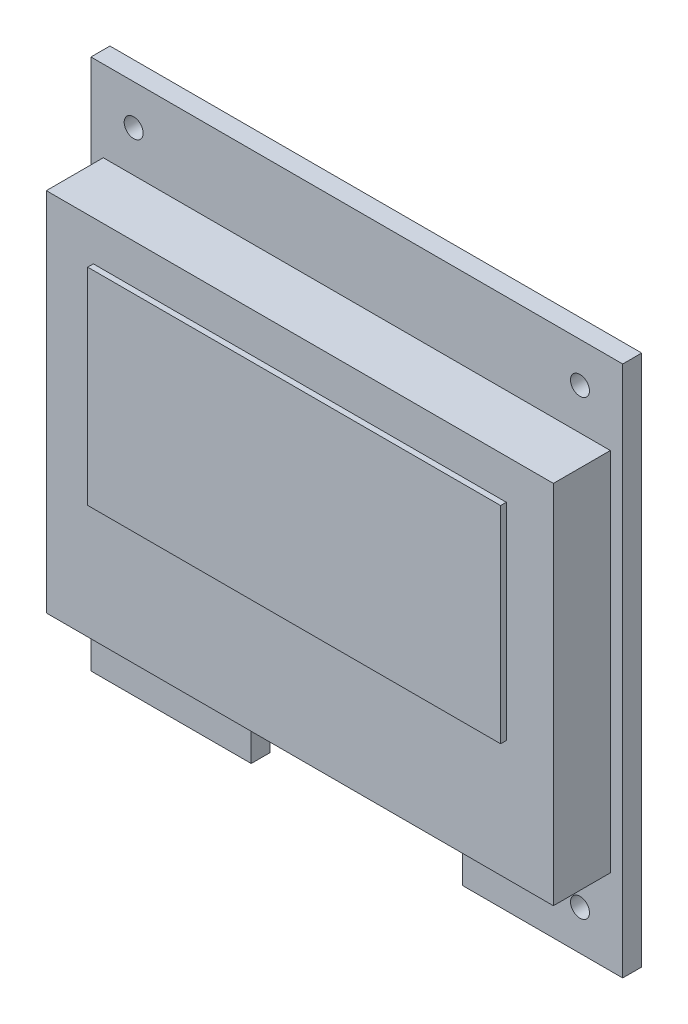
ISO-10303-21;
HEADER;
FILE_DESCRIPTION(('STEP AP214'),'2;1');
FILE_NAME('part.step','',(''),(''),'','','');
FILE_SCHEMA(('AUTOMOTIVE_DESIGN { 1 0 10303 214 1 1 1 1 }'));
ENDSEC;
DATA;
#1=APPLICATION_CONTEXT('core data for automotive mechanical design processes');
#2=APPLICATION_PROTOCOL_DEFINITION('international standard','automotive_design',2000,#1);
#3=PRODUCT_CONTEXT('',#1,'mechanical');
#4=PRODUCT('Part','Part','',(#3));
#5=PRODUCT_RELATED_PRODUCT_CATEGORY('part','',(#4));
#6=PRODUCT_DEFINITION_FORMATION('','',#4);
#7=PRODUCT_DEFINITION_CONTEXT('part definition',#1,'design');
#8=PRODUCT_DEFINITION('design','',#6,#7);
#9=PRODUCT_DEFINITION_SHAPE('','',#8);
#10=(LENGTH_UNIT() NAMED_UNIT(*) SI_UNIT(.MILLI.,.METRE.));
#11=(NAMED_UNIT(*) PLANE_ANGLE_UNIT() SI_UNIT($,.RADIAN.));
#12=(NAMED_UNIT(*) SI_UNIT($,.STERADIAN.) SOLID_ANGLE_UNIT());
#13=UNCERTAINTY_MEASURE_WITH_UNIT(LENGTH_MEASURE(1.E-05),#10,'distance_accuracy_value','');
#14=(GEOMETRIC_REPRESENTATION_CONTEXT(3) GLOBAL_UNCERTAINTY_ASSIGNED_CONTEXT((#13)) GLOBAL_UNIT_ASSIGNED_CONTEXT((#10,
#11,#12)) REPRESENTATION_CONTEXT('',''));
#15=CARTESIAN_POINT('',(0.,0.,0.));
#16=DIRECTION('',(0.,0.,1.));
#17=DIRECTION('',(1.,0.,0.));
#18=AXIS2_PLACEMENT_3D('',#15,#16,#17);
#19=CARTESIAN_POINT('',(0.,0.,4.));
#20=DIRECTION('',(0.,0.,1.));
#21=DIRECTION('',(1.,0.,0.));
#22=AXIS2_PLACEMENT_3D('',#19,#20,#21);
#23=PLANE('',#22);
#24=DIRECTION('',(0.,-1.,0.));
#25=VECTOR('',#24,1.);
#26=CARTESIAN_POINT('',(-10.2845493389436,11.3838799503655,4.));
#27=LINE('',#26,#25);
#28=CARTESIAN_POINT('',(-10.2845493389436,11.3838799503655,4.));
#29=VERTEX_POINT('',#28);
#30=CARTESIAN_POINT('',(-10.2845493389436,-7.87612004963446,4.));
#31=VERTEX_POINT('',#30);
#32=EDGE_CURVE('E195',#29,#31,#27,.T.);
#33=ORIENTED_EDGE('',*,*,#32,.T.);
#34=DIRECTION('',(1.,0.,0.));
#35=VECTOR('',#34,1.);
#36=CARTESIAN_POINT('',(-10.2845493389436,-7.87612004963446,4.));
#37=LINE('',#36,#35);
#38=CARTESIAN_POINT('',(16.4154506610564,-7.87612004963446,4.));
#39=VERTEX_POINT('',#38);
#40=EDGE_CURVE('E198',#31,#39,#37,.T.);
#41=ORIENTED_EDGE('',*,*,#40,.T.);
#42=DIRECTION('',(0.,1.,0.));
#43=VECTOR('',#42,1.);
#44=CARTESIAN_POINT('',(16.4154506610564,11.3838799503655,4.));
#45=LINE('',#44,#43);
#46=CARTESIAN_POINT('',(16.4154506610564,11.3838799503655,4.));
#47=VERTEX_POINT('',#46);
#48=EDGE_CURVE('E202',#39,#47,#45,.T.);
#49=ORIENTED_EDGE('',*,*,#48,.T.);
#50=DIRECTION('',(-1.,0.,0.));
#51=VECTOR('',#50,1.);
#52=CARTESIAN_POINT('',(-10.2845493389436,11.3838799503655,4.));
#53=LINE('',#52,#51);
#54=EDGE_CURVE('E204',#47,#29,#53,.T.);
#55=ORIENTED_EDGE('',*,*,#54,.T.);
#56=EDGE_LOOP('',(#33,#41,#49,#55));
#57=FACE_BOUND('',#56,.T.);
#58=DIRECTION('',(1.,0.,0.));
#59=VECTOR('',#58,1.);
#60=CARTESIAN_POINT('',(-7.80654933894364,-1.58012004963445,4.));
#61=LINE('',#60,#59);
#62=CARTESIAN_POINT('',(-7.80654933894364,-1.58012004963445,4.));
#63=VERTEX_POINT('',#62);
#64=CARTESIAN_POINT('',(13.9374506610564,-1.58012004963445,4.));
#65=VERTEX_POINT('',#64);
#66=EDGE_CURVE('E606',#63,#65,#61,.T.);
#67=ORIENTED_EDGE('',*,*,#66,.F.);
#68=DIRECTION('',(0.,-1.,0.));
#69=VECTOR('',#68,1.);
#70=CARTESIAN_POINT('',(-7.80654933894364,9.28387995036555,4.));
#71=LINE('',#70,#69);
#72=CARTESIAN_POINT('',(-7.80654933894364,9.28387995036555,4.));
#73=VERTEX_POINT('',#72);
#74=EDGE_CURVE('E185',#73,#63,#71,.T.);
#75=ORIENTED_EDGE('',*,*,#74,.F.);
#76=DIRECTION('',(-1.,0.,0.));
#77=VECTOR('',#76,1.);
#78=CARTESIAN_POINT('',(-7.80654933894364,9.28387995036555,4.));
#79=LINE('',#78,#77);
#80=CARTESIAN_POINT('',(13.9374506610564,9.28387995036555,4.));
#81=VERTEX_POINT('',#80);
#82=EDGE_CURVE('E181',#81,#73,#79,.T.);
#83=ORIENTED_EDGE('',*,*,#82,.F.);
#84=DIRECTION('',(0.,1.,0.));
#85=VECTOR('',#84,1.);
#86=CARTESIAN_POINT('',(13.9374506610564,9.28387995036555,4.));
#87=LINE('',#86,#85);
#88=EDGE_CURVE('E603',#65,#81,#87,.T.);
#89=ORIENTED_EDGE('',*,*,#88,.F.);
#90=EDGE_LOOP('',(#67,#75,#83,#89));
#91=FACE_BOUND('',#90,.T.);
#92=ADVANCED_FACE('F41',(#57,#91),#23,.T.);
#93=CARTESIAN_POINT('',(0.,0.,1.));
#94=DIRECTION('',(0.,0.,1.));
#95=DIRECTION('',(1.,0.,0.));
#96=AXIS2_PLACEMENT_3D('',#93,#94,#95);
#97=PLANE('',#96);
#98=CARTESIAN_POINT('',(14.8154506610564,13.5538799503655,1.));
#99=DIRECTION('',(0.,0.,1.));
#100=DIRECTION('',(1.,0.,0.));
#101=AXIS2_PLACEMENT_3D('',#98,#99,#100);
#102=CIRCLE('',#101,0.499999999999999);
#103=CARTESIAN_POINT('',(15.3154506610564,13.5538799503655,1.));
#104=VERTEX_POINT('',#103);
#105=EDGE_CURVE('E229',#104,#104,#102,.T.);
#106=ORIENTED_EDGE('',*,*,#105,.F.);
#107=EDGE_LOOP('',(#106));
#108=FACE_BOUND('',#107,.T.);
#109=CARTESIAN_POINT('',(-8.68454933894364,13.5538799503655,1.));
#110=DIRECTION('',(0.,0.,1.));
#111=DIRECTION('',(1.,0.,0.));
#112=AXIS2_PLACEMENT_3D('',#109,#110,#111);
#113=CIRCLE('',#112,0.500000000000001);
#114=CARTESIAN_POINT('',(-8.18454933894364,13.5538799503655,1.));
#115=VERTEX_POINT('',#114);
#116=EDGE_CURVE('E241',#115,#115,#113,.T.);
#117=ORIENTED_EDGE('',*,*,#116,.F.);
#118=EDGE_LOOP('',(#117));
#119=FACE_BOUND('',#118,.T.);
#120=DIRECTION('',(0.,-1.,0.));
#121=VECTOR('',#120,1.);
#122=CARTESIAN_POINT('',(-10.9345493389436,15.6538799503655,1.));
#123=LINE('',#122,#121);
#124=CARTESIAN_POINT('',(-10.9345493389436,15.6538799503655,1.));
#125=VERTEX_POINT('',#124);
#126=CARTESIAN_POINT('',(-10.9345493389436,-12.3461200496345,1.));
#127=VERTEX_POINT('',#126);
#128=EDGE_CURVE('E249',#125,#127,#123,.T.);
#129=ORIENTED_EDGE('',*,*,#128,.T.);
#130=DIRECTION('',(1.,0.,0.));
#131=VECTOR('',#130,1.);
#132=CARTESIAN_POINT('',(-10.9345493389436,-12.3461200496345,1.));
#133=LINE('',#132,#131);
#134=CARTESIAN_POINT('',(-2.49504614088021,-12.3461200496345,1.));
#135=VERTEX_POINT('',#134);
#136=EDGE_CURVE('E253',#127,#135,#133,.T.);
#137=ORIENTED_EDGE('',*,*,#136,.T.);
#138=DIRECTION('',(0.,1.,0.));
#139=VECTOR('',#138,1.);
#140=CARTESIAN_POINT('',(-2.49504614088021,-12.3461200496345,1.));
#141=LINE('',#140,#139);
#142=CARTESIAN_POINT('',(-2.49504614088021,-10.3461200496345,1.));
#143=VERTEX_POINT('',#142);
#144=EDGE_CURVE('E257',#135,#143,#141,.T.);
#145=ORIENTED_EDGE('',*,*,#144,.T.);
#146=DIRECTION('',(1.,0.,0.));
#147=VECTOR('',#146,1.);
#148=CARTESIAN_POINT('',(-2.49504614088021,-10.3461200496345,1.));
#149=LINE('',#148,#147);
#150=CARTESIAN_POINT('',(8.62594746299293,-10.3461200496345,1.));
#151=VERTEX_POINT('',#150);
#152=EDGE_CURVE('E260',#143,#151,#149,.T.);
#153=ORIENTED_EDGE('',*,*,#152,.T.);
#154=DIRECTION('',(0.,-1.,0.));
#155=VECTOR('',#154,1.);
#156=CARTESIAN_POINT('',(8.62594746299293,-12.3461200496345,1.));
#157=LINE('',#156,#155);
#158=CARTESIAN_POINT('',(8.62594746299293,-12.3461200496345,1.));
#159=VERTEX_POINT('',#158);
#160=EDGE_CURVE('E263',#151,#159,#157,.T.);
#161=ORIENTED_EDGE('',*,*,#160,.T.);
#162=DIRECTION('',(1.,0.,0.));
#163=VECTOR('',#162,1.);
#164=CARTESIAN_POINT('',(8.62594746299293,-12.3461200496345,1.));
#165=LINE('',#164,#163);
#166=CARTESIAN_POINT('',(17.0654506610564,-12.3461200496345,1.));
#167=VERTEX_POINT('',#166);
#168=EDGE_CURVE('E265',#159,#167,#165,.T.);
#169=ORIENTED_EDGE('',*,*,#168,.T.);
#170=DIRECTION('',(0.,1.,0.));
#171=VECTOR('',#170,1.);
#172=CARTESIAN_POINT('',(17.0654506610564,15.6538799503655,1.));
#173=LINE('',#172,#171);
#174=CARTESIAN_POINT('',(17.0654506610564,15.6538799503655,1.));
#175=VERTEX_POINT('',#174);
#176=EDGE_CURVE('E267',#167,#175,#173,.T.);
#177=ORIENTED_EDGE('',*,*,#176,.T.);
#178=DIRECTION('',(-1.,0.,0.));
#179=VECTOR('',#178,1.);
#180=CARTESIAN_POINT('',(-10.9345493389436,15.6538799503655,1.));
#181=LINE('',#180,#179);
#182=EDGE_CURVE('E269',#175,#125,#181,.T.);
#183=ORIENTED_EDGE('',*,*,#182,.T.);
#184=EDGE_LOOP('',(#129,#137,#145,#153,#161,#169,#177,#183));
#185=FACE_BOUND('',#184,.T.);
#186=CARTESIAN_POINT('',(-8.68454933894364,-10.2461200496345,1.));
#187=DIRECTION('',(0.,0.,1.));
#188=DIRECTION('',(1.,0.,0.));
#189=AXIS2_PLACEMENT_3D('',#186,#187,#188);
#190=CIRCLE('',#189,0.500000000000003);
#191=CARTESIAN_POINT('',(-8.18454933894363,-10.2461200496345,1.));
#192=VERTEX_POINT('',#191);
#193=EDGE_CURVE('E235',#192,#192,#190,.T.);
#194=ORIENTED_EDGE('',*,*,#193,.F.);
#195=EDGE_LOOP('',(#194));
#196=FACE_BOUND('',#195,.T.);
#197=CARTESIAN_POINT('',(14.8154506610564,-10.2461200496345,1.));
#198=DIRECTION('',(0.,0.,1.));
#199=DIRECTION('',(1.,0.,0.));
#200=AXIS2_PLACEMENT_3D('',#197,#198,#199);
#201=CIRCLE('',#200,0.499999999999999);
#202=CARTESIAN_POINT('',(15.3154506610564,-10.2461200496345,1.));
#203=VERTEX_POINT('',#202);
#204=EDGE_CURVE('E223',#203,#203,#201,.T.);
#205=ORIENTED_EDGE('',*,*,#204,.F.);
#206=EDGE_LOOP('',(#205));
#207=FACE_BOUND('',#206,.T.);
#208=DIRECTION('',(1.,0.,0.));
#209=VECTOR('',#208,1.);
#210=CARTESIAN_POINT('',(-10.2845493389436,-7.87612004963446,1.));
#211=LINE('',#210,#209);
#212=CARTESIAN_POINT('',(-10.2845493389436,-7.87612004963446,1.));
#213=VERTEX_POINT('',#212);
#214=CARTESIAN_POINT('',(16.4154506610564,-7.87612004963446,1.));
#215=VERTEX_POINT('',#214);
#216=EDGE_CURVE('E190',#213,#215,#211,.T.);
#217=ORIENTED_EDGE('',*,*,#216,.F.);
#218=DIRECTION('',(0.,-1.,0.));
#219=VECTOR('',#218,1.);
#220=CARTESIAN_POINT('',(-10.2845493389436,11.3838799503655,1.));
#221=LINE('',#220,#219);
#222=CARTESIAN_POINT('',(-10.2845493389436,11.3838799503655,1.));
#223=VERTEX_POINT('',#222);
#224=EDGE_CURVE('E187',#223,#213,#221,.T.);
#225=ORIENTED_EDGE('',*,*,#224,.F.);
#226=DIRECTION('',(-1.,0.,0.));
#227=VECTOR('',#226,1.);
#228=CARTESIAN_POINT('',(-10.2845493389436,11.3838799503655,1.));
#229=LINE('',#228,#227);
#230=CARTESIAN_POINT('',(16.4154506610564,11.3838799503655,1.));
#231=VERTEX_POINT('',#230);
#232=EDGE_CURVE('E199',#231,#223,#229,.T.);
#233=ORIENTED_EDGE('',*,*,#232,.F.);
#234=DIRECTION('',(0.,1.,0.));
#235=VECTOR('',#234,1.);
#236=CARTESIAN_POINT('',(16.4154506610564,11.3838799503655,1.));
#237=LINE('',#236,#235);
#238=EDGE_CURVE('E210',#215,#231,#237,.T.);
#239=ORIENTED_EDGE('',*,*,#238,.F.);
#240=EDGE_LOOP('',(#217,#225,#233,#239));
#241=FACE_BOUND('',#240,.T.);
#242=ADVANCED_FACE('F338',(#108,#119,#185,#196,#207,#241),#97,.T.);
#243=CARTESIAN_POINT('',(0.,0.,0.));
#244=DIRECTION('',(0.,0.,1.));
#245=DIRECTION('',(1.,0.,0.));
#246=AXIS2_PLACEMENT_3D('',#243,#244,#245);
#247=PLANE('',#246);
#248=DIRECTION('',(0.,-1.,0.));
#249=VECTOR('',#248,1.);
#250=CARTESIAN_POINT('',(-10.9345493389436,15.6538799503655,0.));
#251=LINE('',#250,#249);
#252=CARTESIAN_POINT('',(-10.9345493389436,15.6538799503655,0.));
#253=VERTEX_POINT('',#252);
#254=CARTESIAN_POINT('',(-10.9345493389436,-12.3461200496345,0.));
#255=VERTEX_POINT('',#254);
#256=EDGE_CURVE('E245',#253,#255,#251,.T.);
#257=ORIENTED_EDGE('',*,*,#256,.F.);
#258=DIRECTION('',(-1.,0.,0.));
#259=VECTOR('',#258,1.);
#260=CARTESIAN_POINT('',(-10.9345493389436,15.6538799503655,0.));
#261=LINE('',#260,#259);
#262=CARTESIAN_POINT('',(17.0654506610564,15.6538799503655,0.));
#263=VERTEX_POINT('',#262);
#264=EDGE_CURVE('E254',#263,#253,#261,.T.);
#265=ORIENTED_EDGE('',*,*,#264,.F.);
#266=DIRECTION('',(0.,1.,0.));
#267=VECTOR('',#266,1.);
#268=CARTESIAN_POINT('',(17.0654506610564,15.6538799503655,0.));
#269=LINE('',#268,#267);
#270=CARTESIAN_POINT('',(17.0654506610564,-12.3461200496345,0.));
#271=VERTEX_POINT('',#270);
#272=EDGE_CURVE('E290',#271,#263,#269,.T.);
#273=ORIENTED_EDGE('',*,*,#272,.F.);
#274=DIRECTION('',(1.,0.,0.));
#275=VECTOR('',#274,1.);
#276=CARTESIAN_POINT('',(8.62594746299293,-12.3461200496345,0.));
#277=LINE('',#276,#275);
#278=CARTESIAN_POINT('',(8.62594746299293,-12.3461200496345,0.));
#279=VERTEX_POINT('',#278);
#280=EDGE_CURVE('E288',#279,#271,#277,.T.);
#281=ORIENTED_EDGE('',*,*,#280,.F.);
#282=DIRECTION('',(0.,-1.,0.));
#283=VECTOR('',#282,1.);
#284=CARTESIAN_POINT('',(8.62594746299293,-12.3461200496345,0.));
#285=LINE('',#284,#283);
#286=CARTESIAN_POINT('',(8.62594746299293,-10.3461200496345,0.));
#287=VERTEX_POINT('',#286);
#288=EDGE_CURVE('E286',#287,#279,#285,.T.);
#289=ORIENTED_EDGE('',*,*,#288,.F.);
#290=DIRECTION('',(1.,0.,0.));
#291=VECTOR('',#290,1.);
#292=CARTESIAN_POINT('',(8.62594746299293,-10.3461200496345,0.));
#293=LINE('',#292,#291);
#294=CARTESIAN_POINT('',(-2.49504614088021,-10.3461200496345,0.));
#295=VERTEX_POINT('',#294);
#296=EDGE_CURVE('E283',#295,#287,#293,.T.);
#297=ORIENTED_EDGE('',*,*,#296,.F.);
#298=DIRECTION('',(0.,1.,0.));
#299=VECTOR('',#298,1.);
#300=CARTESIAN_POINT('',(-2.49504614088021,-12.3461200496345,0.));
#301=LINE('',#300,#299);
#302=CARTESIAN_POINT('',(-2.49504614088021,-12.3461200496345,0.));
#303=VERTEX_POINT('',#302);
#304=EDGE_CURVE('E279',#303,#295,#301,.T.);
#305=ORIENTED_EDGE('',*,*,#304,.F.);
#306=DIRECTION('',(1.,0.,0.));
#307=VECTOR('',#306,1.);
#308=CARTESIAN_POINT('',(-10.9345493389436,-12.3461200496345,0.));
#309=LINE('',#308,#307);
#310=EDGE_CURVE('E276',#255,#303,#309,.T.);
#311=ORIENTED_EDGE('',*,*,#310,.F.);
#312=EDGE_LOOP('',(#257,#265,#273,#281,#289,#297,#305,#311));
#313=FACE_BOUND('',#312,.T.);
#314=CARTESIAN_POINT('',(-8.68454933894364,13.5538799503655,0.));
#315=DIRECTION('',(0.,0.,1.));
#316=DIRECTION('',(1.,0.,0.));
#317=AXIS2_PLACEMENT_3D('',#314,#315,#316);
#318=CIRCLE('',#317,0.500000000000001);
#319=CARTESIAN_POINT('',(-8.18454933894364,13.5538799503655,0.));
#320=VERTEX_POINT('',#319);
#321=EDGE_CURVE('E238',#320,#320,#318,.T.);
#322=ORIENTED_EDGE('',*,*,#321,.T.);
#323=EDGE_LOOP('',(#322));
#324=FACE_BOUND('',#323,.T.);
#325=CARTESIAN_POINT('',(-8.68454933894364,-10.2461200496345,0.));
#326=DIRECTION('',(0.,0.,1.));
#327=DIRECTION('',(1.,0.,0.));
#328=AXIS2_PLACEMENT_3D('',#325,#326,#327);
#329=CIRCLE('',#328,0.500000000000003);
#330=CARTESIAN_POINT('',(-8.18454933894363,-10.2461200496345,0.));
#331=VERTEX_POINT('',#330);
#332=EDGE_CURVE('E232',#331,#331,#329,.T.);
#333=ORIENTED_EDGE('',*,*,#332,.T.);
#334=EDGE_LOOP('',(#333));
#335=FACE_BOUND('',#334,.T.);
#336=CARTESIAN_POINT('',(14.8154506610564,13.5538799503655,0.));
#337=DIRECTION('',(0.,0.,1.));
#338=DIRECTION('',(1.,0.,0.));
#339=AXIS2_PLACEMENT_3D('',#336,#337,#338);
#340=CIRCLE('',#339,0.499999999999999);
#341=CARTESIAN_POINT('',(15.3154506610564,13.5538799503655,0.));
#342=VERTEX_POINT('',#341);
#343=EDGE_CURVE('E226',#342,#342,#340,.T.);
#344=ORIENTED_EDGE('',*,*,#343,.T.);
#345=EDGE_LOOP('',(#344));
#346=FACE_BOUND('',#345,.T.);
#347=CARTESIAN_POINT('',(14.8154506610564,-10.2461200496345,0.));
#348=DIRECTION('',(0.,0.,1.));
#349=DIRECTION('',(1.,0.,0.));
#350=AXIS2_PLACEMENT_3D('',#347,#348,#349);
#351=CIRCLE('',#350,0.499999999999999);
#352=CARTESIAN_POINT('',(15.3154506610564,-10.2461200496345,0.));
#353=VERTEX_POINT('',#352);
#354=EDGE_CURVE('E222',#353,#353,#351,.T.);
#355=ORIENTED_EDGE('',*,*,#354,.T.);
#356=EDGE_LOOP('',(#355));
#357=FACE_BOUND('',#356,.T.);
#358=ADVANCED_FACE('F324',(#313,#324,#335,#346,#357),#247,.F.);
#359=CARTESIAN_POINT('',(-10.9345493389436,15.6538799503655,1.));
#360=DIRECTION('',(1.,0.,0.));
#361=DIRECTION('',(0.,0.,-1.));
#362=AXIS2_PLACEMENT_3D('',#359,#360,#361);
#363=PLANE('',#362);
#364=ORIENTED_EDGE('',*,*,#256,.T.);
#365=DIRECTION('',(0.,0.,-1.));
#366=VECTOR('',#365,1.);
#367=CARTESIAN_POINT('',(-10.9345493389436,-12.3461200496345,1.));
#368=LINE('',#367,#366);
#369=EDGE_CURVE('E11',#127,#255,#368,.T.);
#370=ORIENTED_EDGE('',*,*,#369,.F.);
#371=ORIENTED_EDGE('',*,*,#128,.F.);
#372=DIRECTION('',(0.,0.,-1.));
#373=VECTOR('',#372,1.);
#374=CARTESIAN_POINT('',(-10.9345493389436,15.6538799503655,1.));
#375=LINE('',#374,#373);
#376=EDGE_CURVE('E272',#125,#253,#375,.T.);
#377=ORIENTED_EDGE('',*,*,#376,.T.);
#378=EDGE_LOOP('',(#364,#370,#371,#377));
#379=FACE_BOUND('',#378,.T.);
#380=ADVANCED_FACE('F43',(#379),#363,.F.);
#381=CARTESIAN_POINT('',(-10.9345493389436,-12.3461200496345,1.));
#382=DIRECTION('',(0.,1.,0.));
#383=DIRECTION('',(0.,0.,1.));
#384=AXIS2_PLACEMENT_3D('',#381,#382,#383);
#385=PLANE('',#384);
#386=ORIENTED_EDGE('',*,*,#310,.T.);
#387=DIRECTION('',(0.,0.,-1.));
#388=VECTOR('',#387,1.);
#389=CARTESIAN_POINT('',(-2.49504614088021,-12.3461200496345,1.));
#390=LINE('',#389,#388);
#391=EDGE_CURVE('E49',#135,#303,#390,.T.);
#392=ORIENTED_EDGE('',*,*,#391,.F.);
#393=ORIENTED_EDGE('',*,*,#136,.F.);
#394=ORIENTED_EDGE('',*,*,#369,.T.);
#395=EDGE_LOOP('',(#386,#392,#393,#394));
#396=FACE_BOUND('',#395,.T.);
#397=ADVANCED_FACE('F343',(#396),#385,.F.);
#398=CARTESIAN_POINT('',(-2.49504614088021,-12.3461200496345,1.));
#399=DIRECTION('',(-1.,0.,0.));
#400=DIRECTION('',(0.,0.,1.));
#401=AXIS2_PLACEMENT_3D('',#398,#399,#400);
#402=PLANE('',#401);
#403=ORIENTED_EDGE('',*,*,#304,.T.);
#404=DIRECTION('',(0.,0.,-1.));
#405=VECTOR('',#404,1.);
#406=CARTESIAN_POINT('',(-2.49504614088021,-10.3461200496345,1.));
#407=LINE('',#406,#405);
#408=EDGE_CURVE('E310',#143,#295,#407,.T.);
#409=ORIENTED_EDGE('',*,*,#408,.F.);
#410=ORIENTED_EDGE('',*,*,#144,.F.);
#411=ORIENTED_EDGE('',*,*,#391,.T.);
#412=EDGE_LOOP('',(#403,#409,#410,#411));
#413=FACE_BOUND('',#412,.T.);
#414=ADVANCED_FACE('F319',(#413),#402,.F.);
#415=CARTESIAN_POINT('',(8.62594746299293,-10.3461200496345,1.));
#416=DIRECTION('',(0.,1.,0.));
#417=DIRECTION('',(0.,0.,1.));
#418=AXIS2_PLACEMENT_3D('',#415,#416,#417);
#419=PLANE('',#418);
#420=ORIENTED_EDGE('',*,*,#296,.T.);
#421=DIRECTION('',(0.,0.,-1.));
#422=VECTOR('',#421,1.);
#423=CARTESIAN_POINT('',(8.62594746299293,-10.3461200496345,1.));
#424=LINE('',#423,#422);
#425=EDGE_CURVE('E307',#151,#287,#424,.T.);
#426=ORIENTED_EDGE('',*,*,#425,.F.);
#427=ORIENTED_EDGE('',*,*,#152,.F.);
#428=ORIENTED_EDGE('',*,*,#408,.T.);
#429=EDGE_LOOP('',(#420,#426,#427,#428));
#430=FACE_BOUND('',#429,.T.);
#431=ADVANCED_FACE('F330',(#430),#419,.F.);
#432=CARTESIAN_POINT('',(8.62594746299293,-12.3461200496345,1.));
#433=DIRECTION('',(1.,0.,0.));
#434=DIRECTION('',(0.,0.,-1.));
#435=AXIS2_PLACEMENT_3D('',#432,#433,#434);
#436=PLANE('',#435);
#437=ORIENTED_EDGE('',*,*,#288,.T.);
#438=DIRECTION('',(0.,0.,-1.));
#439=VECTOR('',#438,1.);
#440=CARTESIAN_POINT('',(8.62594746299293,-12.3461200496345,1.));
#441=LINE('',#440,#439);
#442=EDGE_CURVE('E304',#159,#279,#441,.T.);
#443=ORIENTED_EDGE('',*,*,#442,.F.);
#444=ORIENTED_EDGE('',*,*,#160,.F.);
#445=ORIENTED_EDGE('',*,*,#425,.T.);
#446=EDGE_LOOP('',(#437,#443,#444,#445));
#447=FACE_BOUND('',#446,.T.);
#448=ADVANCED_FACE('F334',(#447),#436,.F.);
#449=CARTESIAN_POINT('',(8.62594746299293,-12.3461200496345,1.));
#450=DIRECTION('',(0.,1.,0.));
#451=DIRECTION('',(0.,0.,1.));
#452=AXIS2_PLACEMENT_3D('',#449,#450,#451);
#453=PLANE('',#452);
#454=ORIENTED_EDGE('',*,*,#280,.T.);
#455=DIRECTION('',(0.,0.,-1.));
#456=VECTOR('',#455,1.);
#457=CARTESIAN_POINT('',(17.0654506610564,-12.3461200496345,1.));
#458=LINE('',#457,#456);
#459=EDGE_CURVE('E301',#167,#271,#458,.T.);
#460=ORIENTED_EDGE('',*,*,#459,.F.);
#461=ORIENTED_EDGE('',*,*,#168,.F.);
#462=ORIENTED_EDGE('',*,*,#442,.T.);
#463=EDGE_LOOP('',(#454,#460,#461,#462));
#464=FACE_BOUND('',#463,.T.);
#465=ADVANCED_FACE('F356',(#464),#453,.F.);
#466=CARTESIAN_POINT('',(17.0654506610564,15.6538799503655,1.));
#467=DIRECTION('',(-1.,0.,0.));
#468=DIRECTION('',(0.,0.,1.));
#469=AXIS2_PLACEMENT_3D('',#466,#467,#468);
#470=PLANE('',#469);
#471=ORIENTED_EDGE('',*,*,#272,.T.);
#472=DIRECTION('',(0.,0.,-1.));
#473=VECTOR('',#472,1.);
#474=CARTESIAN_POINT('',(17.0654506610564,15.6538799503655,1.));
#475=LINE('',#474,#473);
#476=EDGE_CURVE('E298',#175,#263,#475,.T.);
#477=ORIENTED_EDGE('',*,*,#476,.F.);
#478=ORIENTED_EDGE('',*,*,#176,.F.);
#479=ORIENTED_EDGE('',*,*,#459,.T.);
#480=EDGE_LOOP('',(#471,#477,#478,#479));
#481=FACE_BOUND('',#480,.T.);
#482=ADVANCED_FACE('F354',(#481),#470,.F.);
#483=CARTESIAN_POINT('',(-10.9345493389436,15.6538799503655,1.));
#484=DIRECTION('',(0.,-1.,0.));
#485=DIRECTION('',(0.,0.,-1.));
#486=AXIS2_PLACEMENT_3D('',#483,#484,#485);
#487=PLANE('',#486);
#488=ORIENTED_EDGE('',*,*,#264,.T.);
#489=ORIENTED_EDGE('',*,*,#376,.F.);
#490=ORIENTED_EDGE('',*,*,#182,.F.);
#491=ORIENTED_EDGE('',*,*,#476,.T.);
#492=EDGE_LOOP('',(#488,#489,#490,#491));
#493=FACE_BOUND('',#492,.T.);
#494=ADVANCED_FACE('F349',(#493),#487,.F.);
#495=CARTESIAN_POINT('',(-8.68454933894364,13.5538799503655,1.));
#496=DIRECTION('',(0.,0.,-1.));
#497=DIRECTION('',(-1.,0.,0.));
#498=AXIS2_PLACEMENT_3D('',#495,#496,#497);
#499=CYLINDRICAL_SURFACE('',#498,0.500000000000001);
#500=ORIENTED_EDGE('',*,*,#116,.T.);
#501=EDGE_LOOP('',(#500));
#502=FACE_BOUND('',#501,.T.);
#503=ORIENTED_EDGE('',*,*,#321,.F.);
#504=EDGE_LOOP('',(#503));
#505=FACE_BOUND('',#504,.T.);
#506=ADVANCED_FACE('F403',(#502,#505),#499,.F.);
#507=CARTESIAN_POINT('',(-8.68454933894364,-10.2461200496345,1.));
#508=DIRECTION('',(0.,0.,-1.));
#509=DIRECTION('',(-1.,0.,0.));
#510=AXIS2_PLACEMENT_3D('',#507,#508,#509);
#511=CYLINDRICAL_SURFACE('',#510,0.500000000000003);
#512=ORIENTED_EDGE('',*,*,#193,.T.);
#513=EDGE_LOOP('',(#512));
#514=FACE_BOUND('',#513,.T.);
#515=ORIENTED_EDGE('',*,*,#332,.F.);
#516=EDGE_LOOP('',(#515));
#517=FACE_BOUND('',#516,.T.);
#518=ADVANCED_FACE('F399',(#514,#517),#511,.F.);
#519=CARTESIAN_POINT('',(14.8154506610564,13.5538799503655,1.));
#520=DIRECTION('',(0.,0.,-1.));
#521=DIRECTION('',(-1.,0.,0.));
#522=AXIS2_PLACEMENT_3D('',#519,#520,#521);
#523=CYLINDRICAL_SURFACE('',#522,0.499999999999999);
#524=ORIENTED_EDGE('',*,*,#105,.T.);
#525=EDGE_LOOP('',(#524));
#526=FACE_BOUND('',#525,.T.);
#527=ORIENTED_EDGE('',*,*,#343,.F.);
#528=EDGE_LOOP('',(#527));
#529=FACE_BOUND('',#528,.T.);
#530=ADVANCED_FACE('F395',(#526,#529),#523,.F.);
#531=CARTESIAN_POINT('',(14.8154506610564,-10.2461200496345,1.));
#532=DIRECTION('',(0.,0.,-1.));
#533=DIRECTION('',(-1.,0.,0.));
#534=AXIS2_PLACEMENT_3D('',#531,#532,#533);
#535=CYLINDRICAL_SURFACE('',#534,0.499999999999999);
#536=ORIENTED_EDGE('',*,*,#204,.T.);
#537=EDGE_LOOP('',(#536));
#538=FACE_BOUND('',#537,.T.);
#539=ORIENTED_EDGE('',*,*,#354,.F.);
#540=EDGE_LOOP('',(#539));
#541=FACE_BOUND('',#540,.T.);
#542=ADVANCED_FACE('F391',(#538,#541),#535,.F.);
#543=CARTESIAN_POINT('',(-10.2845493389436,11.3838799503655,4.));
#544=DIRECTION('',(1.,0.,0.));
#545=DIRECTION('',(0.,1.,0.));
#546=AXIS2_PLACEMENT_3D('',#543,#544,#545);
#547=PLANE('',#546);
#548=ORIENTED_EDGE('',*,*,#224,.T.);
#549=DIRECTION('',(0.,0.,-1.));
#550=VECTOR('',#549,1.);
#551=CARTESIAN_POINT('',(-10.2845493389436,-7.87612004963446,4.));
#552=LINE('',#551,#550);
#553=EDGE_CURVE('E220',#31,#213,#552,.T.);
#554=ORIENTED_EDGE('',*,*,#553,.F.);
#555=ORIENTED_EDGE('',*,*,#32,.F.);
#556=DIRECTION('',(0.,0.,-1.));
#557=VECTOR('',#556,1.);
#558=CARTESIAN_POINT('',(-10.2845493389436,11.3838799503655,4.));
#559=LINE('',#558,#557);
#560=EDGE_CURVE('E206',#29,#223,#559,.T.);
#561=ORIENTED_EDGE('',*,*,#560,.T.);
#562=EDGE_LOOP('',(#548,#554,#555,#561));
#563=FACE_BOUND('',#562,.T.);
#564=ADVANCED_FACE('F387',(#563),#547,.F.);
#565=CARTESIAN_POINT('',(-10.2845493389436,-7.87612004963446,4.));
#566=DIRECTION('',(0.,1.,0.));
#567=DIRECTION('',(0.,0.,1.));
#568=AXIS2_PLACEMENT_3D('',#565,#566,#567);
#569=PLANE('',#568);
#570=ORIENTED_EDGE('',*,*,#216,.T.);
#571=DIRECTION('',(0.,0.,-1.));
#572=VECTOR('',#571,1.);
#573=CARTESIAN_POINT('',(16.4154506610564,-7.87612004963446,4.));
#574=LINE('',#573,#572);
#575=EDGE_CURVE('E217',#39,#215,#574,.T.);
#576=ORIENTED_EDGE('',*,*,#575,.F.);
#577=ORIENTED_EDGE('',*,*,#40,.F.);
#578=ORIENTED_EDGE('',*,*,#553,.T.);
#579=EDGE_LOOP('',(#570,#576,#577,#578));
#580=FACE_BOUND('',#579,.T.);
#581=ADVANCED_FACE('F383',(#580),#569,.F.);
#582=CARTESIAN_POINT('',(16.4154506610564,11.3838799503655,4.));
#583=DIRECTION('',(-1.,0.,0.));
#584=DIRECTION('',(0.,-1.,0.));
#585=AXIS2_PLACEMENT_3D('',#582,#583,#584);
#586=PLANE('',#585);
#587=ORIENTED_EDGE('',*,*,#238,.T.);
#588=DIRECTION('',(0.,0.,-1.));
#589=VECTOR('',#588,1.);
#590=CARTESIAN_POINT('',(16.4154506610564,11.3838799503655,4.));
#591=LINE('',#590,#589);
#592=EDGE_CURVE('E64',#47,#231,#591,.T.);
#593=ORIENTED_EDGE('',*,*,#592,.F.);
#594=ORIENTED_EDGE('',*,*,#48,.F.);
#595=ORIENTED_EDGE('',*,*,#575,.T.);
#596=EDGE_LOOP('',(#587,#593,#594,#595));
#597=FACE_BOUND('',#596,.T.);
#598=ADVANCED_FACE('F380',(#597),#586,.F.);
#599=CARTESIAN_POINT('',(-10.2845493389436,11.3838799503655,4.));
#600=DIRECTION('',(0.,-1.,0.));
#601=DIRECTION('',(0.,0.,-1.));
#602=AXIS2_PLACEMENT_3D('',#599,#600,#601);
#603=PLANE('',#602);
#604=ORIENTED_EDGE('',*,*,#232,.T.);
#605=ORIENTED_EDGE('',*,*,#560,.F.);
#606=ORIENTED_EDGE('',*,*,#54,.F.);
#607=ORIENTED_EDGE('',*,*,#592,.T.);
#608=EDGE_LOOP('',(#604,#605,#606,#607));
#609=FACE_BOUND('',#608,.T.);
#610=ADVANCED_FACE('F377',(#609),#603,.F.);
#611=CARTESIAN_POINT('',(-7.80654933894364,9.28387995036555,4.3));
#612=DIRECTION('',(1.,0.,0.));
#613=DIRECTION('',(0.,1.,0.));
#614=AXIS2_PLACEMENT_3D('',#611,#612,#613);
#615=PLANE('',#614);
#616=ORIENTED_EDGE('',*,*,#74,.T.);
#617=DIRECTION('',(0.,0.,-1.));
#618=VECTOR('',#617,1.);
#619=CARTESIAN_POINT('',(-7.80654933894364,-1.58012004963445,4.3));
#620=LINE('',#619,#618);
#621=CARTESIAN_POINT('',(-7.80654933894364,-1.58012004963445,4.3));
#622=VERTEX_POINT('',#621);
#623=EDGE_CURVE('E165',#622,#63,#620,.T.);
#624=ORIENTED_EDGE('',*,*,#623,.F.);
#625=DIRECTION('',(0.,-1.,0.));
#626=VECTOR('',#625,1.);
#627=CARTESIAN_POINT('',(-7.80654933894364,9.28387995036555,4.3));
#628=LINE('',#627,#626);
#629=CARTESIAN_POINT('',(-7.80654933894364,9.28387995036555,4.3));
#630=VERTEX_POINT('',#629);
#631=EDGE_CURVE('E173',#630,#622,#628,.T.);
#632=ORIENTED_EDGE('',*,*,#631,.F.);
#633=DIRECTION('',(0.,0.,-1.));
#634=VECTOR('',#633,1.);
#635=CARTESIAN_POINT('',(-7.80654933894364,9.28387995036555,4.3));
#636=LINE('',#635,#634);
#637=EDGE_CURVE('E600',#630,#73,#636,.T.);
#638=ORIENTED_EDGE('',*,*,#637,.T.);
#639=EDGE_LOOP('',(#616,#624,#632,#638));
#640=FACE_BOUND('',#639,.T.);
#641=ADVANCED_FACE('F183',(#640),#615,.F.);
#642=CARTESIAN_POINT('',(-7.80654933894364,-1.58012004963445,4.3));
#643=DIRECTION('',(0.,1.,0.));
#644=DIRECTION('',(-1.,0.,0.));
#645=AXIS2_PLACEMENT_3D('',#642,#643,#644);
#646=PLANE('',#645);
#647=ORIENTED_EDGE('',*,*,#66,.T.);
#648=DIRECTION('',(0.,0.,-1.));
#649=VECTOR('',#648,1.);
#650=CARTESIAN_POINT('',(13.9374506610564,-1.58012004963445,4.3));
#651=LINE('',#650,#649);
#652=CARTESIAN_POINT('',(13.9374506610564,-1.58012004963445,4.3));
#653=VERTEX_POINT('',#652);
#654=EDGE_CURVE('E168',#653,#65,#651,.T.);
#655=ORIENTED_EDGE('',*,*,#654,.F.);
#656=DIRECTION('',(1.,0.,0.));
#657=VECTOR('',#656,1.);
#658=CARTESIAN_POINT('',(-7.80654933894364,-1.58012004963445,4.3));
#659=LINE('',#658,#657);
#660=EDGE_CURVE('E161',#622,#653,#659,.T.);
#661=ORIENTED_EDGE('',*,*,#660,.F.);
#662=ORIENTED_EDGE('',*,*,#623,.T.);
#663=EDGE_LOOP('',(#647,#655,#661,#662));
#664=FACE_BOUND('',#663,.T.);
#665=ADVANCED_FACE('F163',(#664),#646,.F.);
#666=CARTESIAN_POINT('',(13.9374506610564,9.28387995036555,4.3));
#667=DIRECTION('',(-1.,0.,0.));
#668=DIRECTION('',(0.,-1.,0.));
#669=AXIS2_PLACEMENT_3D('',#666,#667,#668);
#670=PLANE('',#669);
#671=ORIENTED_EDGE('',*,*,#88,.T.);
#672=DIRECTION('',(0.,0.,-1.));
#673=VECTOR('',#672,1.);
#674=CARTESIAN_POINT('',(13.9374506610564,9.28387995036555,4.3));
#675=LINE('',#674,#673);
#676=CARTESIAN_POINT('',(13.9374506610564,9.28387995036555,4.3));
#677=VERTEX_POINT('',#676);
#678=EDGE_CURVE('E56',#677,#81,#675,.T.);
#679=ORIENTED_EDGE('',*,*,#678,.F.);
#680=DIRECTION('',(0.,1.,0.));
#681=VECTOR('',#680,1.);
#682=CARTESIAN_POINT('',(13.9374506610564,9.28387995036555,4.3));
#683=LINE('',#682,#681);
#684=EDGE_CURVE('E172',#653,#677,#683,.T.);
#685=ORIENTED_EDGE('',*,*,#684,.F.);
#686=ORIENTED_EDGE('',*,*,#654,.T.);
#687=EDGE_LOOP('',(#671,#679,#685,#686));
#688=FACE_BOUND('',#687,.T.);
#689=ADVANCED_FACE('F460',(#688),#670,.F.);
#690=CARTESIAN_POINT('',(-7.80654933894364,9.28387995036555,4.3));
#691=DIRECTION('',(0.,-1.,0.));
#692=DIRECTION('',(1.,0.,0.));
#693=AXIS2_PLACEMENT_3D('',#690,#691,#692);
#694=PLANE('',#693);
#695=ORIENTED_EDGE('',*,*,#82,.T.);
#696=ORIENTED_EDGE('',*,*,#637,.F.);
#697=DIRECTION('',(-1.,0.,0.));
#698=VECTOR('',#697,1.);
#699=CARTESIAN_POINT('',(-7.80654933894364,9.28387995036555,4.3));
#700=LINE('',#699,#698);
#701=EDGE_CURVE('E177',#677,#630,#700,.T.);
#702=ORIENTED_EDGE('',*,*,#701,.F.);
#703=ORIENTED_EDGE('',*,*,#678,.T.);
#704=EDGE_LOOP('',(#695,#696,#702,#703));
#705=FACE_BOUND('',#704,.T.);
#706=ADVANCED_FACE('F464',(#705),#694,.F.);
#707=CARTESIAN_POINT('',(0.,0.,4.3));
#708=DIRECTION('',(0.,0.,1.));
#709=DIRECTION('',(1.,0.,0.));
#710=AXIS2_PLACEMENT_3D('',#707,#708,#709);
#711=PLANE('',#710);
#712=ORIENTED_EDGE('',*,*,#631,.T.);
#713=ORIENTED_EDGE('',*,*,#660,.T.);
#714=ORIENTED_EDGE('',*,*,#684,.T.);
#715=ORIENTED_EDGE('',*,*,#701,.T.);
#716=EDGE_LOOP('',(#712,#713,#714,#715));
#717=FACE_BOUND('',#716,.T.);
#718=ADVANCED_FACE('F176',(#717),#711,.T.);
#719=CLOSED_SHELL('',(#92,#242,#358,#380,#397,#414,#431,#448,#465,#482,#494,#506,#518,#530,#542,
#564,#581,#598,#610,#641,#665,#689,#706,#718));
#720=MANIFOLD_SOLID_BREP('B2',#719);
#721=ADVANCED_BREP_SHAPE_REPRESENTATION('',(#18,#720),#14);
#722=SHAPE_DEFINITION_REPRESENTATION(#9,#721);
ENDSEC;
END-ISO-10303-21;
